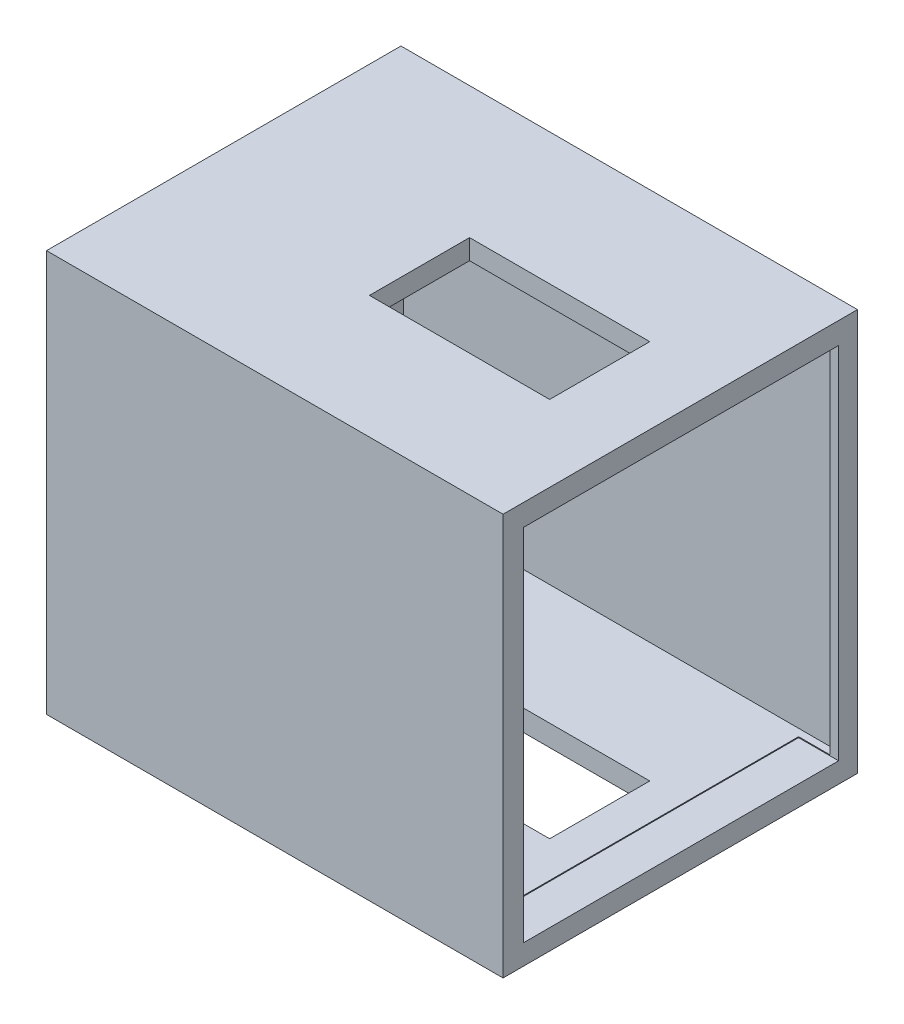
ISO-10303-21;
HEADER;
FILE_DESCRIPTION(('STEP AP214'),'2;1');
FILE_NAME('part.step','',(''),(''),'','','');
FILE_SCHEMA(('AUTOMOTIVE_DESIGN { 1 0 10303 214 1 1 1 1 }'));
ENDSEC;
DATA;
#1=APPLICATION_CONTEXT('core data for automotive mechanical design processes');
#2=APPLICATION_PROTOCOL_DEFINITION('international standard','automotive_design',2000,#1);
#3=PRODUCT_CONTEXT('',#1,'mechanical');
#4=PRODUCT('Part','Part','',(#3));
#5=PRODUCT_RELATED_PRODUCT_CATEGORY('part','',(#4));
#6=PRODUCT_DEFINITION_FORMATION('','',#4);
#7=PRODUCT_DEFINITION_CONTEXT('part definition',#1,'design');
#8=PRODUCT_DEFINITION('design','',#6,#7);
#9=PRODUCT_DEFINITION_SHAPE('','',#8);
#10=(LENGTH_UNIT() NAMED_UNIT(*) SI_UNIT(.MILLI.,.METRE.));
#11=(NAMED_UNIT(*) PLANE_ANGLE_UNIT() SI_UNIT($,.RADIAN.));
#12=(NAMED_UNIT(*) SI_UNIT($,.STERADIAN.) SOLID_ANGLE_UNIT());
#13=UNCERTAINTY_MEASURE_WITH_UNIT(LENGTH_MEASURE(1.E-05),#10,'distance_accuracy_value','');
#14=(GEOMETRIC_REPRESENTATION_CONTEXT(3) GLOBAL_UNCERTAINTY_ASSIGNED_CONTEXT((#13)) GLOBAL_UNIT_ASSIGNED_CONTEXT((#10,
#11,#12)) REPRESENTATION_CONTEXT('',''));
#15=CARTESIAN_POINT('',(0.,0.,0.));
#16=DIRECTION('',(0.,0.,1.));
#17=DIRECTION('',(1.,0.,0.));
#18=AXIS2_PLACEMENT_3D('',#15,#16,#17);
#19=CARTESIAN_POINT('',(76.,200.582631371497,-22.7687170516919));
#20=DIRECTION('',(-1.,0.,0.));
#21=DIRECTION('',(0.,0.,1.));
#22=AXIS2_PLACEMENT_3D('',#19,#20,#21);
#23=PLANE('',#22);
#24=DIRECTION('',(0.,-1.,0.));
#25=VECTOR('',#24,1.);
#26=CARTESIAN_POINT('',(76.,200.582631371497,-22.7687170516919));
#27=LINE('',#26,#25);
#28=CARTESIAN_POINT('',(76.,200.582631371497,-22.7687170516919));
#29=VERTEX_POINT('',#28);
#30=CARTESIAN_POINT('',(76.0000000000218,190.582631371497,-22.7687170516901));
#31=VERTEX_POINT('',#30);
#32=EDGE_CURVE('E382',#29,#31,#27,.T.);
#33=ORIENTED_EDGE('',*,*,#32,.T.);
#34=DIRECTION('',(0.,0.,1.));
#35=VECTOR('',#34,1.);
#36=CARTESIAN_POINT('',(76.0000000000218,190.582631371497,291502.65));
#37=LINE('',#36,#35);
#38=CARTESIAN_POINT('',(76.0000000000218,190.582631371497,27.2312829483212));
#39=VERTEX_POINT('',#38);
#40=EDGE_CURVE('E281',#31,#39,#37,.T.);
#41=ORIENTED_EDGE('',*,*,#40,.T.);
#42=DIRECTION('',(0.,-1.,0.));
#43=VECTOR('',#42,1.);
#44=CARTESIAN_POINT('',(76.,200.582631371497,27.2312829483081));
#45=LINE('',#44,#43);
#46=CARTESIAN_POINT('',(76.,200.582631371497,27.2312829483081));
#47=VERTEX_POINT('',#46);
#48=EDGE_CURVE('E367',#47,#39,#45,.T.);
#49=ORIENTED_EDGE('',*,*,#48,.F.);
#50=DIRECTION('',(0.,0.,-1.));
#51=VECTOR('',#50,1.);
#52=CARTESIAN_POINT('',(76.,200.582631371497,-22.7687170516919));
#53=LINE('',#52,#51);
#54=EDGE_CURVE('E338',#47,#29,#53,.T.);
#55=ORIENTED_EDGE('',*,*,#54,.T.);
#56=EDGE_LOOP('',(#33,#41,#49,#55));
#57=FACE_BOUND('',#56,.T.);
#58=ADVANCED_FACE('F63',(#57),#23,.T.);
#59=CARTESIAN_POINT('',(-14.,200.582631371497,-22.7687170516919));
#60=DIRECTION('',(0.,0.,1.));
#61=DIRECTION('',(1.,0.,0.));
#62=AXIS2_PLACEMENT_3D('',#59,#60,#61);
#63=PLANE('',#62);
#64=DIRECTION('',(0.,-1.,0.));
#65=VECTOR('',#64,1.);
#66=CARTESIAN_POINT('',(-14.,200.582631371497,-22.7687170516919));
#67=LINE('',#66,#65);
#68=CARTESIAN_POINT('',(-14.,200.582631371497,-22.7687170516919));
#69=VERTEX_POINT('',#68);
#70=CARTESIAN_POINT('',(-13.9999999999835,190.582631371497,-22.7687170516901));
#71=VERTEX_POINT('',#70);
#72=EDGE_CURVE('E377',#69,#71,#67,.T.);
#73=ORIENTED_EDGE('',*,*,#72,.T.);
#74=DIRECTION('',(1.,0.,0.));
#75=VECTOR('',#74,1.);
#76=CARTESIAN_POINT('',(-400000.,190.582631371497,-22.7687170516901));
#77=LINE('',#76,#75);
#78=EDGE_CURVE('E263',#71,#31,#77,.T.);
#79=ORIENTED_EDGE('',*,*,#78,.T.);
#80=ORIENTED_EDGE('',*,*,#32,.F.);
#81=DIRECTION('',(-1.,0.,0.));
#82=VECTOR('',#81,1.);
#83=CARTESIAN_POINT('',(-14.,200.582631371497,-22.7687170516919));
#84=LINE('',#83,#82);
#85=EDGE_CURVE('E341',#29,#69,#84,.T.);
#86=ORIENTED_EDGE('',*,*,#85,.T.);
#87=EDGE_LOOP('',(#73,#79,#80,#86));
#88=FACE_BOUND('',#87,.T.);
#89=ADVANCED_FACE('F486',(#88),#63,.T.);
#90=CARTESIAN_POINT('',(-14.,200.582631371497,-22.7687170516919));
#91=DIRECTION('',(1.,0.,0.));
#92=DIRECTION('',(0.,0.,-1.));
#93=AXIS2_PLACEMENT_3D('',#90,#91,#92);
#94=PLANE('',#93);
#95=DIRECTION('',(0.,-1.,0.));
#96=VECTOR('',#95,1.);
#97=CARTESIAN_POINT('',(-14.,200.582631371497,27.2312829483081));
#98=LINE('',#97,#96);
#99=CARTESIAN_POINT('',(-14.,200.582631371497,27.2312829483081));
#100=VERTEX_POINT('',#99);
#101=CARTESIAN_POINT('',(-14.,190.582631371497,27.2312829483081));
#102=VERTEX_POINT('',#101);
#103=EDGE_CURVE('E372',#100,#102,#98,.T.);
#104=ORIENTED_EDGE('',*,*,#103,.T.);
#105=DIRECTION('',(0.,0.,-1.));
#106=VECTOR('',#105,1.);
#107=CARTESIAN_POINT('',(-13.9999999999532,190.582631371497,291502.65));
#108=LINE('',#107,#106);
#109=EDGE_CURVE('E268',#102,#71,#108,.T.);
#110=ORIENTED_EDGE('',*,*,#109,.T.);
#111=ORIENTED_EDGE('',*,*,#72,.F.);
#112=DIRECTION('',(0.,0.,1.));
#113=VECTOR('',#112,1.);
#114=CARTESIAN_POINT('',(-14.,200.582631371497,-22.7687170516919));
#115=LINE('',#114,#113);
#116=EDGE_CURVE('E345',#69,#100,#115,.T.);
#117=ORIENTED_EDGE('',*,*,#116,.T.);
#118=EDGE_LOOP('',(#104,#110,#111,#117));
#119=FACE_BOUND('',#118,.T.);
#120=ADVANCED_FACE('F492',(#119),#94,.T.);
#121=CARTESIAN_POINT('',(-14.,200.582631371497,27.2312829483081));
#122=DIRECTION('',(0.,0.,-1.));
#123=DIRECTION('',(-1.,0.,0.));
#124=AXIS2_PLACEMENT_3D('',#121,#122,#123);
#125=PLANE('',#124);
#126=ORIENTED_EDGE('',*,*,#48,.T.);
#127=DIRECTION('',(-1.,0.,0.));
#128=VECTOR('',#127,1.);
#129=CARTESIAN_POINT('',(-400000.,190.582631371497,27.2312829483212));
#130=LINE('',#129,#128);
#131=EDGE_CURVE('E285',#39,#102,#130,.T.);
#132=ORIENTED_EDGE('',*,*,#131,.T.);
#133=ORIENTED_EDGE('',*,*,#103,.F.);
#134=DIRECTION('',(1.,0.,0.));
#135=VECTOR('',#134,1.);
#136=CARTESIAN_POINT('',(-14.,200.582631371497,27.2312829483081));
#137=LINE('',#136,#135);
#138=EDGE_CURVE('E349',#100,#47,#137,.T.);
#139=ORIENTED_EDGE('',*,*,#138,.T.);
#140=EDGE_LOOP('',(#126,#132,#133,#139));
#141=FACE_BOUND('',#140,.T.);
#142=ADVANCED_FACE('F546',(#141),#125,.T.);
#143=CARTESIAN_POINT('',(0.,200.582631371497,0.));
#144=DIRECTION('',(0.,1.,0.));
#145=DIRECTION('',(0.,0.,1.));
#146=AXIS2_PLACEMENT_3D('',#143,#144,#145);
#147=PLANE('',#146);
#148=DIRECTION('',(0.,0.,-1.));
#149=VECTOR('',#148,1.);
#150=CARTESIAN_POINT('',(114.,200.582631371497,-88.5));
#151=LINE('',#150,#149);
#152=CARTESIAN_POINT('',(114.,200.582631371497,88.5));
#153=VERTEX_POINT('',#152);
#154=CARTESIAN_POINT('',(114.,200.582631371497,-88.5));
#155=VERTEX_POINT('',#154);
#156=EDGE_CURVE('E387',#153,#155,#151,.T.);
#157=ORIENTED_EDGE('',*,*,#156,.T.);
#158=DIRECTION('',(-1.,0.,0.));
#159=VECTOR('',#158,1.);
#160=CARTESIAN_POINT('',(-114.,200.582631371497,-88.5));
#161=LINE('',#160,#159);
#162=CARTESIAN_POINT('',(-114.,200.582631371497,-88.5));
#163=VERTEX_POINT('',#162);
#164=EDGE_CURVE('E391',#155,#163,#161,.T.);
#165=ORIENTED_EDGE('',*,*,#164,.T.);
#166=DIRECTION('',(0.,0.,1.));
#167=VECTOR('',#166,1.);
#168=CARTESIAN_POINT('',(-114.,200.582631371497,-88.5));
#169=LINE('',#168,#167);
#170=CARTESIAN_POINT('',(-114.,200.582631371497,88.5));
#171=VERTEX_POINT('',#170);
#172=EDGE_CURVE('E395',#163,#171,#169,.T.);
#173=ORIENTED_EDGE('',*,*,#172,.T.);
#174=DIRECTION('',(1.,0.,0.));
#175=VECTOR('',#174,1.);
#176=CARTESIAN_POINT('',(-114.,200.582631371497,88.5));
#177=LINE('',#176,#175);
#178=EDGE_CURVE('E398',#171,#153,#177,.T.);
#179=ORIENTED_EDGE('',*,*,#178,.T.);
#180=EDGE_LOOP('',(#157,#165,#173,#179));
#181=FACE_BOUND('',#180,.T.);
#182=ORIENTED_EDGE('',*,*,#85,.F.);
#183=ORIENTED_EDGE('',*,*,#54,.F.);
#184=ORIENTED_EDGE('',*,*,#138,.F.);
#185=ORIENTED_EDGE('',*,*,#116,.F.);
#186=EDGE_LOOP('',(#182,#183,#184,#185));
#187=FACE_BOUND('',#186,.T.);
#188=ADVANCED_FACE('F469',(#181,#187),#147,.T.);
#189=CARTESIAN_POINT('',(0.,0.,0.));
#190=DIRECTION('',(0.,1.,0.));
#191=DIRECTION('',(0.,0.,1.));
#192=AXIS2_PLACEMENT_3D('',#189,#190,#191);
#193=PLANE('',#192);
#194=DIRECTION('',(0.,0.,-1.));
#195=VECTOR('',#194,1.);
#196=CARTESIAN_POINT('',(114.,0.,-88.5));
#197=LINE('',#196,#195);
#198=CARTESIAN_POINT('',(114.,0.,88.5));
#199=VERTEX_POINT('',#198);
#200=CARTESIAN_POINT('',(114.,0.,-88.5));
#201=VERTEX_POINT('',#200);
#202=EDGE_CURVE('E386',#199,#201,#197,.T.);
#203=ORIENTED_EDGE('',*,*,#202,.F.);
#204=DIRECTION('',(1.,0.,0.));
#205=VECTOR('',#204,1.);
#206=CARTESIAN_POINT('',(-114.,0.,88.5));
#207=LINE('',#206,#205);
#208=CARTESIAN_POINT('',(-114.,0.,88.5));
#209=VERTEX_POINT('',#208);
#210=EDGE_CURVE('E392',#209,#199,#207,.T.);
#211=ORIENTED_EDGE('',*,*,#210,.F.);
#212=DIRECTION('',(0.,0.,1.));
#213=VECTOR('',#212,1.);
#214=CARTESIAN_POINT('',(-114.,0.,-88.5));
#215=LINE('',#214,#213);
#216=CARTESIAN_POINT('',(-114.,0.,-88.5));
#217=VERTEX_POINT('',#216);
#218=EDGE_CURVE('E408',#217,#209,#215,.T.);
#219=ORIENTED_EDGE('',*,*,#218,.F.);
#220=DIRECTION('',(-1.,0.,0.));
#221=VECTOR('',#220,1.);
#222=CARTESIAN_POINT('',(-114.,0.,-88.5));
#223=LINE('',#222,#221);
#224=EDGE_CURVE('E405',#201,#217,#223,.T.);
#225=ORIENTED_EDGE('',*,*,#224,.F.);
#226=EDGE_LOOP('',(#203,#211,#219,#225));
#227=FACE_BOUND('',#226,.T.);
#228=DIRECTION('',(0.,0.,-1.));
#229=VECTOR('',#228,1.);
#230=CARTESIAN_POINT('',(76.,0.,-22.7687170516919));
#231=LINE('',#230,#229);
#232=CARTESIAN_POINT('',(76.,0.,27.2312829483081));
#233=VERTEX_POINT('',#232);
#234=CARTESIAN_POINT('',(76.,0.,-22.7687170516919));
#235=VERTEX_POINT('',#234);
#236=EDGE_CURVE('E337',#233,#235,#231,.T.);
#237=ORIENTED_EDGE('',*,*,#236,.T.);
#238=DIRECTION('',(-1.,0.,0.));
#239=VECTOR('',#238,1.);
#240=CARTESIAN_POINT('',(-14.,0.,-22.7687170516919));
#241=LINE('',#240,#239);
#242=CARTESIAN_POINT('',(-14.,0.,-22.7687170516919));
#243=VERTEX_POINT('',#242);
#244=EDGE_CURVE('E356',#235,#243,#241,.T.);
#245=ORIENTED_EDGE('',*,*,#244,.T.);
#246=DIRECTION('',(0.,0.,1.));
#247=VECTOR('',#246,1.);
#248=CARTESIAN_POINT('',(-14.,0.,-22.7687170516919));
#249=LINE('',#248,#247);
#250=CARTESIAN_POINT('',(-14.,0.,27.2312829483081));
#251=VERTEX_POINT('',#250);
#252=EDGE_CURVE('E360',#243,#251,#249,.T.);
#253=ORIENTED_EDGE('',*,*,#252,.T.);
#254=DIRECTION('',(1.,0.,0.));
#255=VECTOR('',#254,1.);
#256=CARTESIAN_POINT('',(-14.,0.,27.2312829483081));
#257=LINE('',#256,#255);
#258=EDGE_CURVE('E342',#251,#233,#257,.T.);
#259=ORIENTED_EDGE('',*,*,#258,.T.);
#260=EDGE_LOOP('',(#237,#245,#253,#259));
#261=FACE_BOUND('',#260,.T.);
#262=ADVANCED_FACE('F456',(#227,#261),#193,.F.);
#263=CARTESIAN_POINT('',(114.,200.582631371497,-88.5));
#264=DIRECTION('',(-1.,0.,0.));
#265=DIRECTION('',(0.,0.,1.));
#266=AXIS2_PLACEMENT_3D('',#263,#264,#265);
#267=PLANE('',#266);
#268=DIRECTION('',(0.,-1.,0.));
#269=VECTOR('',#268,1.);
#270=CARTESIAN_POINT('',(114.,189.788878898134,-79.0774421660325));
#271=LINE('',#270,#269);
#272=CARTESIAN_POINT('',(114.,189.788878898134,-79.0774421660325));
#273=VERTEX_POINT('',#272);
#274=CARTESIAN_POINT('',(114.,10.1429082566931,-79.0774421660325));
#275=VERTEX_POINT('',#274);
#276=EDGE_CURVE('E243',#273,#275,#271,.T.);
#277=ORIENTED_EDGE('',*,*,#276,.T.);
#278=DIRECTION('',(0.,0.,-1.));
#279=VECTOR('',#278,1.);
#280=CARTESIAN_POINT('',(114.,10.1429082566932,78.2260043956327));
#281=LINE('',#280,#279);
#282=CARTESIAN_POINT('',(114.,10.1429082566932,78.2260043956327));
#283=VERTEX_POINT('',#282);
#284=EDGE_CURVE('E79',#283,#275,#281,.T.);
#285=ORIENTED_EDGE('',*,*,#284,.F.);
#286=DIRECTION('',(0.,-1.,0.));
#287=VECTOR('',#286,1.);
#288=CARTESIAN_POINT('',(114.,189.788878898134,78.2260043956327));
#289=LINE('',#288,#287);
#290=CARTESIAN_POINT('',(114.,189.788878898134,78.2260043956327));
#291=VERTEX_POINT('',#290);
#292=EDGE_CURVE('E232',#291,#283,#289,.T.);
#293=ORIENTED_EDGE('',*,*,#292,.F.);
#294=DIRECTION('',(0.,0.,-1.));
#295=VECTOR('',#294,1.);
#296=CARTESIAN_POINT('',(114.,189.788878898134,78.2260043956327));
#297=LINE('',#296,#295);
#298=EDGE_CURVE('E236',#291,#273,#297,.T.);
#299=ORIENTED_EDGE('',*,*,#298,.T.);
#300=EDGE_LOOP('',(#277,#285,#293,#299));
#301=FACE_BOUND('',#300,.T.);
#302=ORIENTED_EDGE('',*,*,#202,.T.);
#303=DIRECTION('',(0.,-1.,0.));
#304=VECTOR('',#303,1.);
#305=CARTESIAN_POINT('',(114.,200.582631371497,-88.5));
#306=LINE('',#305,#304);
#307=EDGE_CURVE('E424',#155,#201,#306,.T.);
#308=ORIENTED_EDGE('',*,*,#307,.F.);
#309=ORIENTED_EDGE('',*,*,#156,.F.);
#310=DIRECTION('',(0.,-1.,0.));
#311=VECTOR('',#310,1.);
#312=CARTESIAN_POINT('',(114.,200.582631371497,88.5));
#313=LINE('',#312,#311);
#314=EDGE_CURVE('E401',#153,#199,#313,.T.);
#315=ORIENTED_EDGE('',*,*,#314,.T.);
#316=EDGE_LOOP('',(#302,#308,#309,#315));
#317=FACE_BOUND('',#316,.T.);
#318=ADVANCED_FACE('F65',(#301,#317),#267,.F.);
#319=CARTESIAN_POINT('',(-114.,200.582631371497,-88.5));
#320=DIRECTION('',(0.,0.,1.));
#321=DIRECTION('',(1.,0.,0.));
#322=AXIS2_PLACEMENT_3D('',#319,#320,#321);
#323=PLANE('',#322);
#324=ORIENTED_EDGE('',*,*,#224,.T.);
#325=DIRECTION('',(0.,-1.,0.));
#326=VECTOR('',#325,1.);
#327=CARTESIAN_POINT('',(-114.,200.582631371497,-88.5));
#328=LINE('',#327,#326);
#329=EDGE_CURVE('E420',#163,#217,#328,.T.);
#330=ORIENTED_EDGE('',*,*,#329,.F.);
#331=ORIENTED_EDGE('',*,*,#164,.F.);
#332=ORIENTED_EDGE('',*,*,#307,.T.);
#333=EDGE_LOOP('',(#324,#330,#331,#332));
#334=FACE_BOUND('',#333,.T.);
#335=ADVANCED_FACE('F455',(#334),#323,.F.);
#336=CARTESIAN_POINT('',(-114.,200.582631371497,-88.5));
#337=DIRECTION('',(1.,0.,0.));
#338=DIRECTION('',(0.,0.,-1.));
#339=AXIS2_PLACEMENT_3D('',#336,#337,#338);
#340=PLANE('',#339);
#341=ORIENTED_EDGE('',*,*,#218,.T.);
#342=DIRECTION('',(0.,-1.,0.));
#343=VECTOR('',#342,1.);
#344=CARTESIAN_POINT('',(-114.,200.582631371497,88.5));
#345=LINE('',#344,#343);
#346=EDGE_CURVE('E416',#171,#209,#345,.T.);
#347=ORIENTED_EDGE('',*,*,#346,.F.);
#348=ORIENTED_EDGE('',*,*,#172,.F.);
#349=ORIENTED_EDGE('',*,*,#329,.T.);
#350=EDGE_LOOP('',(#341,#347,#348,#349));
#351=FACE_BOUND('',#350,.T.);
#352=ADVANCED_FACE('F476',(#351),#340,.F.);
#353=CARTESIAN_POINT('',(-114.,200.582631371497,88.5));
#354=DIRECTION('',(0.,0.,-1.));
#355=DIRECTION('',(-1.,0.,0.));
#356=AXIS2_PLACEMENT_3D('',#353,#354,#355);
#357=PLANE('',#356);
#358=ORIENTED_EDGE('',*,*,#210,.T.);
#359=ORIENTED_EDGE('',*,*,#314,.F.);
#360=ORIENTED_EDGE('',*,*,#178,.F.);
#361=ORIENTED_EDGE('',*,*,#346,.T.);
#362=EDGE_LOOP('',(#358,#359,#360,#361));
#363=FACE_BOUND('',#362,.T.);
#364=ADVANCED_FACE('F474',(#363),#357,.F.);
#365=DIRECTION('',(0.,0.,1.));
#366=VECTOR('',#365,1.);
#367=CARTESIAN_POINT('',(76.0000000000218,10.5826313714973,291502.65));
#368=LINE('',#367,#366);
#369=CARTESIAN_POINT('',(76.0000000000218,10.5826313714973,-22.7687170516901));
#370=VERTEX_POINT('',#369);
#371=CARTESIAN_POINT('',(76.,10.5826313714973,27.2312829483081));
#372=VERTEX_POINT('',#371);
#373=EDGE_CURVE('E267',#370,#372,#368,.T.);
#374=ORIENTED_EDGE('',*,*,#373,.F.);
#375=EDGE_CURVE('E381',#370,#235,#27,.T.);
#376=ORIENTED_EDGE('',*,*,#375,.T.);
#377=ORIENTED_EDGE('',*,*,#236,.F.);
#378=EDGE_CURVE('E352',#372,#233,#45,.T.);
#379=ORIENTED_EDGE('',*,*,#378,.F.);
#380=EDGE_LOOP('',(#374,#376,#377,#379));
#381=FACE_BOUND('',#380,.T.);
#382=ADVANCED_FACE('F483',(#381),#23,.T.);
#383=DIRECTION('',(1.,0.,0.));
#384=VECTOR('',#383,1.);
#385=CARTESIAN_POINT('',(-400000.,10.5826313714973,-22.7687170516901));
#386=LINE('',#385,#384);
#387=CARTESIAN_POINT('',(-13.9999999999835,10.5826313714973,-22.7687170516901));
#388=VERTEX_POINT('',#387);
#389=EDGE_CURVE('E264',#388,#370,#386,.T.);
#390=ORIENTED_EDGE('',*,*,#389,.F.);
#391=EDGE_CURVE('E376',#388,#243,#67,.T.);
#392=ORIENTED_EDGE('',*,*,#391,.T.);
#393=ORIENTED_EDGE('',*,*,#244,.F.);
#394=ORIENTED_EDGE('',*,*,#375,.F.);
#395=EDGE_LOOP('',(#390,#392,#393,#394));
#396=FACE_BOUND('',#395,.T.);
#397=ADVANCED_FACE('F495',(#396),#63,.T.);
#398=DIRECTION('',(0.,0.,-1.));
#399=VECTOR('',#398,1.);
#400=CARTESIAN_POINT('',(-13.9999999999532,10.5826313714973,291502.65));
#401=LINE('',#400,#399);
#402=CARTESIAN_POINT('',(-13.9999999999835,10.5826313714973,27.2312829483212));
#403=VERTEX_POINT('',#402);
#404=EDGE_CURVE('E274',#403,#388,#401,.T.);
#405=ORIENTED_EDGE('',*,*,#404,.F.);
#406=EDGE_CURVE('E371',#403,#251,#98,.T.);
#407=ORIENTED_EDGE('',*,*,#406,.T.);
#408=ORIENTED_EDGE('',*,*,#252,.F.);
#409=ORIENTED_EDGE('',*,*,#391,.F.);
#410=EDGE_LOOP('',(#405,#407,#408,#409));
#411=FACE_BOUND('',#410,.T.);
#412=ADVANCED_FACE('F502',(#411),#94,.T.);
#413=DIRECTION('',(-1.,0.,0.));
#414=VECTOR('',#413,1.);
#415=CARTESIAN_POINT('',(-400000.,10.5826313714973,27.2312829483212));
#416=LINE('',#415,#414);
#417=EDGE_CURVE('E271',#372,#403,#416,.T.);
#418=ORIENTED_EDGE('',*,*,#417,.F.);
#419=ORIENTED_EDGE('',*,*,#378,.T.);
#420=ORIENTED_EDGE('',*,*,#258,.F.);
#421=ORIENTED_EDGE('',*,*,#406,.F.);
#422=EDGE_LOOP('',(#418,#419,#420,#421));
#423=FACE_BOUND('',#422,.T.);
#424=ADVANCED_FACE('F542',(#423),#125,.T.);
#425=CARTESIAN_POINT('',(0.,10.5826313714973,0.));
#426=DIRECTION('',(0.,-1.,0.));
#427=DIRECTION('',(0.,0.,-1.));
#428=AXIS2_PLACEMENT_3D('',#425,#426,#427);
#429=PLANE('',#428);
#430=DIRECTION('',(0.,0.,1.));
#431=VECTOR('',#430,1.);
#432=CARTESIAN_POINT('',(109.792925820443,10.5826313714973,291502.65));
#433=LINE('',#432,#431);
#434=CARTESIAN_POINT('',(109.792925820443,10.5826313714973,78.2260043956171));
#435=VERTEX_POINT('',#434);
#436=CARTESIAN_POINT('',(109.792925820443,10.5826313714973,82.0025444305088));
#437=VERTEX_POINT('',#436);
#438=EDGE_CURVE('E296',#435,#437,#433,.T.);
#439=ORIENTED_EDGE('',*,*,#438,.F.);
#440=DIRECTION('',(-1.,0.,0.));
#441=VECTOR('',#440,1.);
#442=CARTESIAN_POINT('',(0.,10.5826313714973,78.2260043956327));
#443=LINE('',#442,#441);
#444=CARTESIAN_POINT('',(94.,10.5826313714973,78.2260043956327));
#445=VERTEX_POINT('',#444);
#446=EDGE_CURVE('E259',#435,#445,#443,.T.);
#447=ORIENTED_EDGE('',*,*,#446,.T.);
#448=DIRECTION('',(0.,0.,-1.));
#449=VECTOR('',#448,1.);
#450=CARTESIAN_POINT('',(94.,10.5826313714973,0.));
#451=LINE('',#450,#449);
#452=CARTESIAN_POINT('',(94.,10.5826313714973,-79.0774421660325));
#453=VERTEX_POINT('',#452);
#454=EDGE_CURVE('E12',#445,#453,#451,.T.);
#455=ORIENTED_EDGE('',*,*,#454,.T.);
#456=DIRECTION('',(-1.,0.,0.));
#457=VECTOR('',#456,1.);
#458=CARTESIAN_POINT('',(0.,10.5826313714973,-79.0774421660325));
#459=LINE('',#458,#457);
#460=CARTESIAN_POINT('',(109.792925820443,10.5826313714973,-79.0774421660103));
#461=VERTEX_POINT('',#460);
#462=EDGE_CURVE('E217',#461,#453,#459,.T.);
#463=ORIENTED_EDGE('',*,*,#462,.F.);
#464=CARTESIAN_POINT('',(109.792925820443,10.5826313714973,-82.7084241755642));
#465=VERTEX_POINT('',#464);
#466=EDGE_CURVE('E298',#465,#461,#433,.T.);
#467=ORIENTED_EDGE('',*,*,#466,.F.);
#468=DIRECTION('',(1.,0.,0.));
#469=VECTOR('',#468,1.);
#470=CARTESIAN_POINT('',(-400000.,10.5826313714973,-82.7084241755642));
#471=LINE('',#470,#469);
#472=CARTESIAN_POINT('',(-106.940226900178,10.5826313714973,-82.7084241755642));
#473=VERTEX_POINT('',#472);
#474=EDGE_CURVE('E292',#473,#465,#471,.T.);
#475=ORIENTED_EDGE('',*,*,#474,.F.);
#476=DIRECTION('',(0.,0.,1.));
#477=VECTOR('',#476,1.);
#478=CARTESIAN_POINT('',(-106.940226900178,10.5826313714973,291502.65));
#479=LINE('',#478,#477);
#480=CARTESIAN_POINT('',(-106.940226900178,10.5826313714973,82.0025444305088));
#481=VERTEX_POINT('',#480);
#482=EDGE_CURVE('E306',#473,#481,#479,.T.);
#483=ORIENTED_EDGE('',*,*,#482,.T.);
#484=DIRECTION('',(1.,0.,0.));
#485=VECTOR('',#484,1.);
#486=CARTESIAN_POINT('',(-400000.,10.5826313714973,82.0025444305088));
#487=LINE('',#486,#485);
#488=EDGE_CURVE('E302',#481,#437,#487,.T.);
#489=ORIENTED_EDGE('',*,*,#488,.T.);
#490=EDGE_LOOP('',(#439,#447,#455,#463,#467,#475,#483,#489));
#491=FACE_BOUND('',#490,.T.);
#492=ORIENTED_EDGE('',*,*,#373,.T.);
#493=ORIENTED_EDGE('',*,*,#417,.T.);
#494=ORIENTED_EDGE('',*,*,#404,.T.);
#495=ORIENTED_EDGE('',*,*,#389,.T.);
#496=EDGE_LOOP('',(#492,#493,#494,#495));
#497=FACE_BOUND('',#496,.T.);
#498=ADVANCED_FACE('F449',(#491,#497),#429,.F.);
#499=CARTESIAN_POINT('',(0.,190.582631371497,0.));
#500=DIRECTION('',(0.,-1.,0.));
#501=DIRECTION('',(0.,0.,-1.));
#502=AXIS2_PLACEMENT_3D('',#499,#500,#501);
#503=PLANE('',#502);
#504=DIRECTION('',(1.,0.,0.));
#505=VECTOR('',#504,1.);
#506=CARTESIAN_POINT('',(-400000.,190.582631371497,-82.7084241755642));
#507=LINE('',#506,#505);
#508=CARTESIAN_POINT('',(-106.940226900178,190.582631371497,-82.7084241755642));
#509=VERTEX_POINT('',#508);
#510=CARTESIAN_POINT('',(109.792925820443,190.582631371497,-82.7084241755642));
#511=VERTEX_POINT('',#510);
#512=EDGE_CURVE('E277',#509,#511,#507,.T.);
#513=ORIENTED_EDGE('',*,*,#512,.T.);
#514=DIRECTION('',(0.,0.,1.));
#515=VECTOR('',#514,1.);
#516=CARTESIAN_POINT('',(109.792925820443,190.582631371497,291502.65));
#517=LINE('',#516,#515);
#518=CARTESIAN_POINT('',(109.792925820443,190.582631371497,82.0025444305088));
#519=VERTEX_POINT('',#518);
#520=EDGE_CURVE('E314',#511,#519,#517,.T.);
#521=ORIENTED_EDGE('',*,*,#520,.T.);
#522=DIRECTION('',(1.,0.,0.));
#523=VECTOR('',#522,1.);
#524=CARTESIAN_POINT('',(-400000.,190.582631371497,82.0025444305088));
#525=LINE('',#524,#523);
#526=CARTESIAN_POINT('',(-106.940226900178,190.582631371497,82.0025444305088));
#527=VERTEX_POINT('',#526);
#528=EDGE_CURVE('E318',#527,#519,#525,.T.);
#529=ORIENTED_EDGE('',*,*,#528,.F.);
#530=DIRECTION('',(0.,0.,1.));
#531=VECTOR('',#530,1.);
#532=CARTESIAN_POINT('',(-106.940226900178,190.582631371497,291502.65));
#533=LINE('',#532,#531);
#534=EDGE_CURVE('E297',#509,#527,#533,.T.);
#535=ORIENTED_EDGE('',*,*,#534,.F.);
#536=EDGE_LOOP('',(#513,#521,#529,#535));
#537=FACE_BOUND('',#536,.T.);
#538=ORIENTED_EDGE('',*,*,#78,.F.);
#539=ORIENTED_EDGE('',*,*,#109,.F.);
#540=ORIENTED_EDGE('',*,*,#131,.F.);
#541=ORIENTED_EDGE('',*,*,#40,.F.);
#542=EDGE_LOOP('',(#538,#539,#540,#541));
#543=FACE_BOUND('',#542,.T.);
#544=ADVANCED_FACE('F528',(#537,#543),#503,.T.);
#545=CARTESIAN_POINT('',(-400000.,10.5826313714973,-82.7084241755642));
#546=DIRECTION('',(0.,0.,1.));
#547=DIRECTION('',(1.,0.,0.));
#548=AXIS2_PLACEMENT_3D('',#545,#546,#547);
#549=PLANE('',#548);
#550=ORIENTED_EDGE('',*,*,#512,.F.);
#551=DIRECTION('',(0.,1.,0.));
#552=VECTOR('',#551,1.);
#553=CARTESIAN_POINT('',(-106.940226900178,10.5826313714973,-82.7084241755642));
#554=LINE('',#553,#552);
#555=EDGE_CURVE('E310',#473,#509,#554,.T.);
#556=ORIENTED_EDGE('',*,*,#555,.F.);
#557=ORIENTED_EDGE('',*,*,#474,.T.);
#558=DIRECTION('',(0.,1.,0.));
#559=VECTOR('',#558,1.);
#560=CARTESIAN_POINT('',(109.792925820443,10.5826313714973,-82.7084241755642));
#561=LINE('',#560,#559);
#562=EDGE_CURVE('E333',#465,#511,#561,.T.);
#563=ORIENTED_EDGE('',*,*,#562,.T.);
#564=EDGE_LOOP('',(#550,#556,#557,#563));
#565=FACE_BOUND('',#564,.T.);
#566=ADVANCED_FACE('F531',(#565),#549,.T.);
#567=CARTESIAN_POINT('',(109.792925820443,10.5826313714973,291502.65));
#568=DIRECTION('',(-1.,0.,0.));
#569=DIRECTION('',(0.,0.,1.));
#570=AXIS2_PLACEMENT_3D('',#567,#568,#569);
#571=PLANE('',#570);
#572=DIRECTION('',(0.,1.,0.));
#573=VECTOR('',#572,1.);
#574=CARTESIAN_POINT('',(109.792925820443,10.5826313714973,78.2260043956171));
#575=LINE('',#574,#573);
#576=CARTESIAN_POINT('',(109.792925820443,189.788878898134,78.2260043956327));
#577=VERTEX_POINT('',#576);
#578=EDGE_CURVE('E72',#435,#577,#575,.T.);
#579=ORIENTED_EDGE('',*,*,#578,.F.);
#580=ORIENTED_EDGE('',*,*,#438,.T.);
#581=DIRECTION('',(0.,1.,0.));
#582=VECTOR('',#581,1.);
#583=CARTESIAN_POINT('',(109.792925820443,10.5826313714973,82.0025444305088));
#584=LINE('',#583,#582);
#585=EDGE_CURVE('E330',#437,#519,#584,.T.);
#586=ORIENTED_EDGE('',*,*,#585,.T.);
#587=ORIENTED_EDGE('',*,*,#520,.F.);
#588=ORIENTED_EDGE('',*,*,#562,.F.);
#589=ORIENTED_EDGE('',*,*,#466,.T.);
#590=DIRECTION('',(0.,1.,0.));
#591=VECTOR('',#590,1.);
#592=CARTESIAN_POINT('',(109.792925820443,10.5826313714973,-79.0774421660103));
#593=LINE('',#592,#591);
#594=CARTESIAN_POINT('',(109.792925820443,189.788878898134,-79.0774421660103));
#595=VERTEX_POINT('',#594);
#596=EDGE_CURVE('E428',#461,#595,#593,.T.);
#597=ORIENTED_EDGE('',*,*,#596,.T.);
#598=DIRECTION('',(0.,0.,1.));
#599=VECTOR('',#598,1.);
#600=CARTESIAN_POINT('',(109.792925820443,189.788878898134,291502.65));
#601=LINE('',#600,#599);
#602=EDGE_CURVE('E432',#595,#577,#601,.T.);
#603=ORIENTED_EDGE('',*,*,#602,.T.);
#604=EDGE_LOOP('',(#579,#580,#586,#587,#588,#589,#597,#603));
#605=FACE_BOUND('',#604,.T.);
#606=ADVANCED_FACE('F446',(#605),#571,.T.);
#607=CARTESIAN_POINT('',(-400000.,10.5826313714973,82.0025444305088));
#608=DIRECTION('',(0.,0.,1.));
#609=DIRECTION('',(1.,0.,0.));
#610=AXIS2_PLACEMENT_3D('',#607,#608,#609);
#611=PLANE('',#610);
#612=ORIENTED_EDGE('',*,*,#528,.T.);
#613=ORIENTED_EDGE('',*,*,#585,.F.);
#614=ORIENTED_EDGE('',*,*,#488,.F.);
#615=DIRECTION('',(0.,1.,0.));
#616=VECTOR('',#615,1.);
#617=CARTESIAN_POINT('',(-106.940226900178,10.5826313714973,82.0025444305088));
#618=LINE('',#617,#616);
#619=EDGE_CURVE('E327',#481,#527,#618,.T.);
#620=ORIENTED_EDGE('',*,*,#619,.T.);
#621=EDGE_LOOP('',(#612,#613,#614,#620));
#622=FACE_BOUND('',#621,.T.);
#623=ADVANCED_FACE('F520',(#622),#611,.F.);
#624=CARTESIAN_POINT('',(-106.940226900178,10.5826313714973,291502.65));
#625=DIRECTION('',(-1.,0.,0.));
#626=DIRECTION('',(0.,0.,1.));
#627=AXIS2_PLACEMENT_3D('',#624,#625,#626);
#628=PLANE('',#627);
#629=ORIENTED_EDGE('',*,*,#534,.T.);
#630=ORIENTED_EDGE('',*,*,#619,.F.);
#631=ORIENTED_EDGE('',*,*,#482,.F.);
#632=ORIENTED_EDGE('',*,*,#555,.T.);
#633=EDGE_LOOP('',(#629,#630,#631,#632));
#634=FACE_BOUND('',#633,.T.);
#635=ADVANCED_FACE('F524',(#634),#628,.F.);
#636=CARTESIAN_POINT('',(94.,0.,0.));
#637=DIRECTION('',(-1.,0.,0.));
#638=DIRECTION('',(0.,0.,1.));
#639=AXIS2_PLACEMENT_3D('',#636,#637,#638);
#640=PLANE('',#639);
#641=DIRECTION('',(0.,-1.,0.));
#642=VECTOR('',#641,1.);
#643=CARTESIAN_POINT('',(94.,189.788878898134,78.2260043956327));
#644=LINE('',#643,#642);
#645=CARTESIAN_POINT('',(94.,10.1429082566932,78.2260043956327));
#646=VERTEX_POINT('',#645);
#647=EDGE_CURVE('E221',#445,#646,#644,.T.);
#648=ORIENTED_EDGE('',*,*,#647,.T.);
#649=DIRECTION('',(0.,0.,-1.));
#650=VECTOR('',#649,1.);
#651=CARTESIAN_POINT('',(94.,10.1429082566932,78.2260043956327));
#652=LINE('',#651,#650);
#653=CARTESIAN_POINT('',(94.,10.1429082566932,-79.0774421660325));
#654=VERTEX_POINT('',#653);
#655=EDGE_CURVE('E222',#646,#654,#652,.T.);
#656=ORIENTED_EDGE('',*,*,#655,.T.);
#657=DIRECTION('',(0.,-1.,0.));
#658=VECTOR('',#657,1.);
#659=CARTESIAN_POINT('',(94.,189.788878898134,-79.0774421660325));
#660=LINE('',#659,#658);
#661=EDGE_CURVE('E212',#453,#654,#660,.T.);
#662=ORIENTED_EDGE('',*,*,#661,.F.);
#663=ORIENTED_EDGE('',*,*,#454,.F.);
#664=EDGE_LOOP('',(#648,#656,#662,#663));
#665=FACE_BOUND('',#664,.T.);
#666=ADVANCED_FACE('F228',(#665),#640,.F.);
#667=CARTESIAN_POINT('',(94.,189.788878898134,78.2260043956327));
#668=DIRECTION('',(0.,0.,1.));
#669=DIRECTION('',(1.,0.,0.));
#670=AXIS2_PLACEMENT_3D('',#667,#668,#669);
#671=PLANE('',#670);
#672=ORIENTED_EDGE('',*,*,#578,.T.);
#673=DIRECTION('',(1.,0.,0.));
#674=VECTOR('',#673,1.);
#675=CARTESIAN_POINT('',(94.,189.788878898134,78.2260043956327));
#676=LINE('',#675,#674);
#677=EDGE_CURVE('E252',#577,#291,#676,.T.);
#678=ORIENTED_EDGE('',*,*,#677,.T.);
#679=ORIENTED_EDGE('',*,*,#292,.T.);
#680=DIRECTION('',(1.,0.,0.));
#681=VECTOR('',#680,1.);
#682=CARTESIAN_POINT('',(94.,10.1429082566932,78.2260043956327));
#683=LINE('',#682,#681);
#684=EDGE_CURVE('E249',#646,#283,#683,.T.);
#685=ORIENTED_EDGE('',*,*,#684,.F.);
#686=ORIENTED_EDGE('',*,*,#647,.F.);
#687=ORIENTED_EDGE('',*,*,#446,.F.);
#688=EDGE_LOOP('',(#672,#678,#679,#685,#686,#687));
#689=FACE_BOUND('',#688,.T.);
#690=ADVANCED_FACE('F439',(#689),#671,.F.);
#691=CARTESIAN_POINT('',(94.,189.788878898134,-79.0774421660325));
#692=DIRECTION('',(0.,0.,1.));
#693=DIRECTION('',(1.,0.,0.));
#694=AXIS2_PLACEMENT_3D('',#691,#692,#693);
#695=PLANE('',#694);
#696=ORIENTED_EDGE('',*,*,#462,.T.);
#697=ORIENTED_EDGE('',*,*,#661,.T.);
#698=DIRECTION('',(1.,0.,0.));
#699=VECTOR('',#698,1.);
#700=CARTESIAN_POINT('',(94.,10.1429082566932,-79.0774421660325));
#701=LINE('',#700,#699);
#702=EDGE_CURVE('E214',#654,#275,#701,.T.);
#703=ORIENTED_EDGE('',*,*,#702,.T.);
#704=ORIENTED_EDGE('',*,*,#276,.F.);
#705=DIRECTION('',(1.,0.,0.));
#706=VECTOR('',#705,1.);
#707=CARTESIAN_POINT('',(94.,189.788878898134,-79.0774421660325));
#708=LINE('',#707,#706);
#709=EDGE_CURVE('E87',#595,#273,#708,.T.);
#710=ORIENTED_EDGE('',*,*,#709,.F.);
#711=ORIENTED_EDGE('',*,*,#596,.F.);
#712=EDGE_LOOP('',(#696,#697,#703,#704,#710,#711));
#713=FACE_BOUND('',#712,.T.);
#714=ADVANCED_FACE('F213',(#713),#695,.T.);
#715=CARTESIAN_POINT('',(94.,10.1429082566932,78.2260043956327));
#716=DIRECTION('',(0.,-1.,0.));
#717=DIRECTION('',(0.,0.,-1.));
#718=AXIS2_PLACEMENT_3D('',#715,#716,#717);
#719=PLANE('',#718);
#720=ORIENTED_EDGE('',*,*,#284,.T.);
#721=ORIENTED_EDGE('',*,*,#702,.F.);
#722=ORIENTED_EDGE('',*,*,#655,.F.);
#723=ORIENTED_EDGE('',*,*,#684,.T.);
#724=EDGE_LOOP('',(#720,#721,#722,#723));
#725=FACE_BOUND('',#724,.T.);
#726=ADVANCED_FACE('F225',(#725),#719,.F.);
#727=CARTESIAN_POINT('',(94.,189.788878898134,78.2260043956327));
#728=DIRECTION('',(0.,-1.,0.));
#729=DIRECTION('',(0.,0.,-1.));
#730=AXIS2_PLACEMENT_3D('',#727,#728,#729);
#731=PLANE('',#730);
#732=ORIENTED_EDGE('',*,*,#709,.T.);
#733=ORIENTED_EDGE('',*,*,#298,.F.);
#734=ORIENTED_EDGE('',*,*,#677,.F.);
#735=ORIENTED_EDGE('',*,*,#602,.F.);
#736=EDGE_LOOP('',(#732,#733,#734,#735));
#737=FACE_BOUND('',#736,.T.);
#738=ADVANCED_FACE('F444',(#737),#731,.T.);
#739=CLOSED_SHELL('',(#58,#89,#120,#142,#188,#262,#318,#335,#352,#364,#382,#397,#412,#424,#498,
#544,#566,#606,#623,#635,#666,#690,#714,#726,#738));
#740=MANIFOLD_SOLID_BREP('B2',#739);
#741=ADVANCED_BREP_SHAPE_REPRESENTATION('',(#18,#740),#14);
#742=SHAPE_DEFINITION_REPRESENTATION(#9,#741);
ENDSEC;
END-ISO-10303-21;
